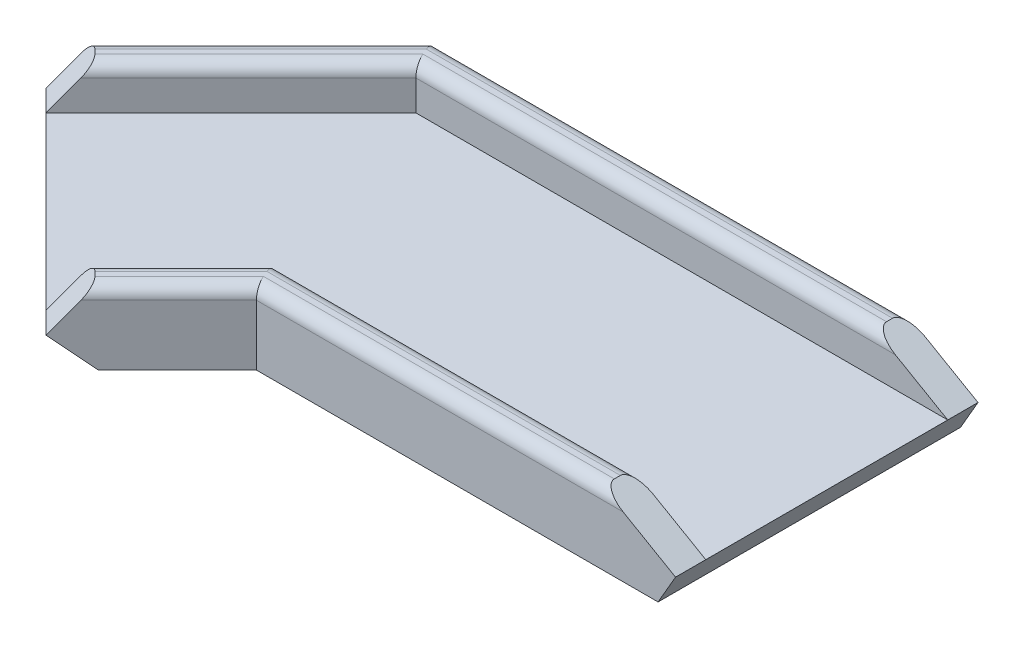
ISO-10303-21;
HEADER;
FILE_DESCRIPTION(('STEP AP214'),'2;1');
FILE_NAME('part.step','',(''),(''),'','','');
FILE_SCHEMA(('AUTOMOTIVE_DESIGN { 1 0 10303 214 1 1 1 1 }'));
ENDSEC;
DATA;
#1=APPLICATION_CONTEXT('core data for automotive mechanical design processes');
#2=APPLICATION_PROTOCOL_DEFINITION('international standard','automotive_design',2000,#1);
#3=PRODUCT_CONTEXT('',#1,'mechanical');
#4=PRODUCT('Part','Part','',(#3));
#5=PRODUCT_RELATED_PRODUCT_CATEGORY('part','',(#4));
#6=PRODUCT_DEFINITION_FORMATION('','',#4);
#7=PRODUCT_DEFINITION_CONTEXT('part definition',#1,'design');
#8=PRODUCT_DEFINITION('design','',#6,#7);
#9=PRODUCT_DEFINITION_SHAPE('','',#8);
#10=(LENGTH_UNIT() NAMED_UNIT(*) SI_UNIT(.MILLI.,.METRE.));
#11=(NAMED_UNIT(*) PLANE_ANGLE_UNIT() SI_UNIT($,.RADIAN.));
#12=(NAMED_UNIT(*) SI_UNIT($,.STERADIAN.) SOLID_ANGLE_UNIT());
#13=UNCERTAINTY_MEASURE_WITH_UNIT(LENGTH_MEASURE(1.E-05),#10,'distance_accuracy_value','');
#14=(GEOMETRIC_REPRESENTATION_CONTEXT(3) GLOBAL_UNCERTAINTY_ASSIGNED_CONTEXT((#13)) GLOBAL_UNIT_ASSIGNED_CONTEXT((#10,
#11,#12)) REPRESENTATION_CONTEXT('',''));
#15=CARTESIAN_POINT('',(0.,0.,0.));
#16=DIRECTION('',(0.,0.,1.));
#17=DIRECTION('',(1.,0.,0.));
#18=AXIS2_PLACEMENT_3D('',#15,#16,#17);
#19=CARTESIAN_POINT('',(0.,3.175,-63.5));
#20=DIRECTION('',(0.,-1.,0.));
#21=DIRECTION('',(0.,0.,-1.));
#22=AXIS2_PLACEMENT_3D('',#19,#20,#21);
#23=PLANE('',#22);
#24=DIRECTION('',(-0.707106781186548,0.,0.707106781186548));
#25=VECTOR('',#24,1.);
#26=CARTESIAN_POINT('',(-33.477694910378,3.175,-6.35));
#27=LINE('',#26,#25);
#28=CARTESIAN_POINT('',(-33.477694910378,3.175,-6.35));
#29=VERTEX_POINT('',#28);
#30=CARTESIAN_POINT('',(-57.4223975332805,3.17499999999999,17.5947026229025));
#31=VERTEX_POINT('',#30);
#32=EDGE_CURVE('E205',#29,#31,#27,.T.);
#33=ORIENTED_EDGE('',*,*,#32,.F.);
#34=DIRECTION('',(-1.,0.,0.));
#35=VECTOR('',#34,1.);
#36=CARTESIAN_POINT('',(-57.15,3.175,-6.35));
#37=LINE('',#36,#35);
#38=CARTESIAN_POINT('',(57.15,3.175,-6.35));
#39=VERTEX_POINT('',#38);
#40=EDGE_CURVE('E375',#39,#29,#37,.T.);
#41=ORIENTED_EDGE('',*,*,#40,.F.);
#42=DIRECTION('',(0.,0.,1.));
#43=VECTOR('',#42,1.);
#44=CARTESIAN_POINT('',(57.15,3.175,-63.5));
#45=LINE('',#44,#43);
#46=CARTESIAN_POINT('',(57.15,3.175,-57.15));
#47=VERTEX_POINT('',#46);
#48=EDGE_CURVE('E390',#47,#39,#45,.T.);
#49=ORIENTED_EDGE('',*,*,#48,.F.);
#50=DIRECTION('',(1.,0.,0.));
#51=VECTOR('',#50,1.);
#52=CARTESIAN_POINT('',(57.15,3.175,-57.15));
#53=LINE('',#52,#51);
#54=CARTESIAN_POINT('',(-54.5197438789309,3.175,-57.15));
#55=VERTEX_POINT('',#54);
#56=EDGE_CURVE('E284',#55,#47,#53,.T.);
#57=ORIENTED_EDGE('',*,*,#56,.F.);
#58=DIRECTION('',(0.707106781186553,0.,-0.707106781186542));
#59=VECTOR('',#58,1.);
#60=CARTESIAN_POINT('',(-93.3434220175569,3.175,-18.3263218613746));
#61=LINE('',#60,#59);
#62=CARTESIAN_POINT('',(-93.3434220175569,3.17499999999999,-18.3263218613746));
#63=VERTEX_POINT('',#62);
#64=EDGE_CURVE('E200',#63,#55,#61,.T.);
#65=ORIENTED_EDGE('',*,*,#64,.F.);
#66=DIRECTION('',(0.707106781186542,0.,0.707106781186553));
#67=VECTOR('',#66,1.);
#68=CARTESIAN_POINT('',(-97.8335500780916,3.175,-22.8164499219093));
#69=LINE('',#68,#67);
#70=EDGE_CURVE('E202',#63,#31,#69,.T.);
#71=ORIENTED_EDGE('',*,*,#70,.T.);
#72=EDGE_LOOP('',(#33,#41,#49,#57,#65,#71));
#73=FACE_BOUND('',#72,.T.);
#74=ADVANCED_FACE('F36',(#73),#23,.F.);
#75=CARTESIAN_POINT('',(0.,-3.175,-63.5));
#76=DIRECTION('',(0.,-1.,0.));
#77=DIRECTION('',(0.,0.,-1.));
#78=AXIS2_PLACEMENT_3D('',#75,#76,#77);
#79=PLANE('',#78);
#80=DIRECTION('',(0.707106781186541,0.,0.707106781186554));
#81=VECTOR('',#80,1.);
#82=CARTESIAN_POINT('',(-112.676076303106,-3.175,-48.6574987749863));
#83=LINE('',#82,#81);
#84=CARTESIAN_POINT('',(-92.3342887640602,-3.17499999999999,-28.3157112359405));
#85=VERTEX_POINT('',#84);
#86=CARTESIAN_POINT('',(-47.4330081587148,-3.175,16.5855693694056));
#87=VERTEX_POINT('',#86);
#88=EDGE_CURVE('E172',#85,#87,#83,.T.);
#89=ORIENTED_EDGE('',*,*,#88,.F.);
#90=DIRECTION('',(-0.707106781186553,0.,0.707106781186542));
#91=VECTOR('',#90,1.);
#92=CARTESIAN_POINT('',(-57.1500000000001,-3.175,-63.5000000000001));
#93=LINE('',#92,#91);
#94=CARTESIAN_POINT('',(-57.15,-3.175,-63.5));
#95=VERTEX_POINT('',#94);
#96=EDGE_CURVE('E199',#95,#85,#93,.T.);
#97=ORIENTED_EDGE('',*,*,#96,.F.);
#98=DIRECTION('',(1.,0.,0.));
#99=VECTOR('',#98,1.);
#100=CARTESIAN_POINT('',(0.,-3.175,-63.5));
#101=LINE('',#100,#99);
#102=CARTESIAN_POINT('',(53.4838257906459,-3.175,-63.5));
#103=VERTEX_POINT('',#102);
#104=EDGE_CURVE('E279',#95,#103,#101,.T.);
#105=ORIENTED_EDGE('',*,*,#104,.T.);
#106=DIRECTION('',(0.,0.,1.));
#107=VECTOR('',#106,1.);
#108=CARTESIAN_POINT('',(53.4838257906459,-3.175,-63.5));
#109=LINE('',#108,#107);
#110=CARTESIAN_POINT('',(53.4838257906459,-3.175,0.));
#111=VERTEX_POINT('',#110);
#112=EDGE_CURVE('E227',#103,#111,#109,.T.);
#113=ORIENTED_EDGE('',*,*,#112,.T.);
#114=DIRECTION('',(1.,0.,0.));
#115=VECTOR('',#114,1.);
#116=CARTESIAN_POINT('',(0.,-3.175,0.));
#117=LINE('',#116,#115);
#118=CARTESIAN_POINT('',(-30.8474387893089,-3.175,0.));
#119=VERTEX_POINT('',#118);
#120=EDGE_CURVE('E198',#119,#111,#117,.T.);
#121=ORIENTED_EDGE('',*,*,#120,.F.);
#122=DIRECTION('',(0.707106781186554,0.,-0.707106781186542));
#123=VECTOR('',#122,1.);
#124=CARTESIAN_POINT('',(-52.9322694727462,-3.175,22.0848306834369));
#125=LINE('',#124,#123);
#126=EDGE_CURVE('E191',#87,#119,#125,.T.);
#127=ORIENTED_EDGE('',*,*,#126,.F.);
#128=EDGE_LOOP('',(#89,#97,#105,#113,#121,#127));
#129=FACE_BOUND('',#128,.T.);
#130=ADVANCED_FACE('F196',(#129),#79,.T.);
#131=CARTESIAN_POINT('',(0.,0.,-63.5));
#132=DIRECTION('',(0.,0.,1.));
#133=DIRECTION('',(1.,0.,0.));
#134=AXIS2_PLACEMENT_3D('',#131,#132,#133);
#135=PLANE('',#134);
#136=DIRECTION('',(0.,-1.,0.));
#137=VECTOR('',#136,1.);
#138=CARTESIAN_POINT('',(-57.15,0.,-63.5));
#139=LINE('',#138,#137);
#140=CARTESIAN_POINT('',(-57.15,9.525,-63.5));
#141=VERTEX_POINT('',#140);
#142=EDGE_CURVE('E276',#141,#95,#139,.T.);
#143=ORIENTED_EDGE('',*,*,#142,.F.);
#144=DIRECTION('',(-1.,0.,0.));
#145=VECTOR('',#144,1.);
#146=CARTESIAN_POINT('',(0.,9.525,-63.5));
#147=LINE('',#146,#145);
#148=CARTESIAN_POINT('',(46.1514773719375,9.525,-63.5));
#149=VERTEX_POINT('',#148);
#150=EDGE_CURVE('E270',#141,#149,#147,.F.);
#151=ORIENTED_EDGE('',*,*,#150,.T.);
#152=DIRECTION('',(0.866025403784442,-0.499999999999995,0.));
#153=VECTOR('',#152,1.);
#154=CARTESIAN_POINT('',(57.15,3.175,-63.5));
#155=LINE('',#154,#153);
#156=CARTESIAN_POINT('',(57.15,3.175,-63.5));
#157=VERTEX_POINT('',#156);
#158=EDGE_CURVE('E217',#149,#157,#155,.T.);
#159=ORIENTED_EDGE('',*,*,#158,.T.);
#160=DIRECTION('',(-0.499999999999996,-0.866025403784441,0.));
#161=VECTOR('',#160,1.);
#162=CARTESIAN_POINT('',(57.15,3.175,-63.5));
#163=LINE('',#162,#161);
#164=EDGE_CURVE('E219',#157,#103,#163,.T.);
#165=ORIENTED_EDGE('',*,*,#164,.T.);
#166=ORIENTED_EDGE('',*,*,#104,.F.);
#167=EDGE_LOOP('',(#143,#151,#159,#165,#166));
#168=FACE_BOUND('',#167,.T.);
#169=ADVANCED_FACE('F335',(#168),#135,.F.);
#170=CARTESIAN_POINT('',(0.,0.,0.));
#171=DIRECTION('',(0.,0.,1.));
#172=DIRECTION('',(1.,0.,0.));
#173=AXIS2_PLACEMENT_3D('',#170,#171,#172);
#174=PLANE('',#173);
#175=DIRECTION('',(0.866025403784442,-0.499999999999995,0.));
#176=VECTOR('',#175,1.);
#177=CARTESIAN_POINT('',(57.15,3.175,0.));
#178=LINE('',#177,#176);
#179=CARTESIAN_POINT('',(46.1514773719375,9.525,0.));
#180=VERTEX_POINT('',#179);
#181=CARTESIAN_POINT('',(57.15,3.175,0.));
#182=VERTEX_POINT('',#181);
#183=EDGE_CURVE('E216',#180,#182,#178,.T.);
#184=ORIENTED_EDGE('',*,*,#183,.F.);
#185=DIRECTION('',(1.,0.,0.));
#186=VECTOR('',#185,1.);
#187=CARTESIAN_POINT('',(-30.8474387893089,9.525,0.));
#188=LINE('',#187,#186);
#189=CARTESIAN_POINT('',(-30.8474387893089,9.52499999999999,0.));
#190=VERTEX_POINT('',#189);
#191=EDGE_CURVE('E304',#180,#190,#188,.F.);
#192=ORIENTED_EDGE('',*,*,#191,.T.);
#193=DIRECTION('',(0.,1.,0.));
#194=VECTOR('',#193,1.);
#195=CARTESIAN_POINT('',(-30.8474387893089,-3.175,0.));
#196=LINE('',#195,#194);
#197=EDGE_CURVE('E209',#119,#190,#196,.T.);
#198=ORIENTED_EDGE('',*,*,#197,.F.);
#199=ORIENTED_EDGE('',*,*,#120,.T.);
#200=DIRECTION('',(-0.499999999999996,-0.866025403784441,0.));
#201=VECTOR('',#200,1.);
#202=CARTESIAN_POINT('',(57.15,3.175,0.));
#203=LINE('',#202,#201);
#204=EDGE_CURVE('E220',#182,#111,#203,.T.);
#205=ORIENTED_EDGE('',*,*,#204,.F.);
#206=EDGE_LOOP('',(#184,#192,#198,#199,#205));
#207=FACE_BOUND('',#206,.T.);
#208=ADVANCED_FACE('F423',(#207),#174,.T.);
#209=CARTESIAN_POINT('',(57.15,12.065,-57.15));
#210=DIRECTION('',(0.,0.,-1.));
#211=DIRECTION('',(-1.,0.,0.));
#212=AXIS2_PLACEMENT_3D('',#209,#210,#211);
#213=PLANE('',#212);
#214=DIRECTION('',(-0.866025403784442,0.499999999999995,0.));
#215=VECTOR('',#214,1.);
#216=CARTESIAN_POINT('',(53.3005170801782,5.39749999999995,-57.15));
#217=LINE('',#216,#215);
#218=CARTESIAN_POINT('',(46.1514773719375,9.525,-57.15));
#219=VERTEX_POINT('',#218);
#220=EDGE_CURVE('E381',#47,#219,#217,.T.);
#221=ORIENTED_EDGE('',*,*,#220,.T.);
#222=DIRECTION('',(1.,0.,0.));
#223=VECTOR('',#222,1.);
#224=CARTESIAN_POINT('',(57.15,9.525,-57.15));
#225=LINE('',#224,#223);
#226=CARTESIAN_POINT('',(-54.5197438789309,9.525,-57.15));
#227=VERTEX_POINT('',#226);
#228=EDGE_CURVE('E268',#219,#227,#225,.F.);
#229=ORIENTED_EDGE('',*,*,#228,.T.);
#230=DIRECTION('',(0.,-1.,0.));
#231=VECTOR('',#230,1.);
#232=CARTESIAN_POINT('',(-54.5197438789309,12.065,-57.15));
#233=LINE('',#232,#231);
#234=EDGE_CURVE('E214',#227,#55,#233,.T.);
#235=ORIENTED_EDGE('',*,*,#234,.T.);
#236=ORIENTED_EDGE('',*,*,#56,.T.);
#237=EDGE_LOOP('',(#221,#229,#235,#236));
#238=FACE_BOUND('',#237,.T.);
#239=ADVANCED_FACE('F531',(#238),#213,.F.);
#240=CARTESIAN_POINT('',(0.,12.065,0.));
#241=DIRECTION('',(0.,-1.,0.));
#242=DIRECTION('',(0.,0.,-1.));
#243=AXIS2_PLACEMENT_3D('',#240,#241,#242);
#244=PLANE('',#243);
#245=DIRECTION('',(0.707106781186553,0.,-0.707106781186542));
#246=VECTOR('',#245,1.);
#247=CARTESIAN_POINT('',(-58.5289487757858,12.065,-58.5289487757868));
#248=LINE('',#247,#246);
#249=CARTESIAN_POINT('',(-56.0978975515725,12.065,-60.96));
#250=VERTEX_POINT('',#249);
#251=CARTESIAN_POINT('',(-90.904854960782,12.065,-26.1530425907911));
#252=VERTEX_POINT('',#251);
#253=EDGE_CURVE('E313',#250,#252,#248,.F.);
#254=ORIENTED_EDGE('',*,*,#253,.T.);
#255=DIRECTION('',(0.707106781186542,0.,0.707106781186554));
#256=VECTOR('',#255,1.);
#257=CARTESIAN_POINT('',(-32.3759061849963,12.065,32.3759061849957));
#258=LINE('',#257,#256);
#259=CARTESIAN_POINT('',(-90.006829348675,12.065,-25.2550169786841));
#260=VERTEX_POINT('',#259);
#261=EDGE_CURVE('E50',#252,#260,#258,.T.);
#262=ORIENTED_EDGE('',*,*,#261,.T.);
#263=DIRECTION('',(-0.707106781186553,0.,0.707106781186542));
#264=VECTOR('',#263,1.);
#265=CARTESIAN_POINT('',(-57.6309231636788,12.065,-57.6309231636797));
#266=LINE('',#265,#264);
#267=CARTESIAN_POINT('',(-55.5718463273586,12.065,-59.69));
#268=VERTEX_POINT('',#267);
#269=EDGE_CURVE('E272',#260,#268,#266,.F.);
#270=ORIENTED_EDGE('',*,*,#269,.T.);
#271=DIRECTION('',(1.,0.,0.));
#272=VECTOR('',#271,1.);
#273=CARTESIAN_POINT('',(0.,12.065,-59.69));
#274=LINE('',#273,#272);
#275=CARTESIAN_POINT('',(41.7520683207125,12.065,-59.69));
#276=VERTEX_POINT('',#275);
#277=EDGE_CURVE('E266',#268,#276,#274,.T.);
#278=ORIENTED_EDGE('',*,*,#277,.T.);
#279=DIRECTION('',(0.,0.,1.));
#280=VECTOR('',#279,1.);
#281=CARTESIAN_POINT('',(41.7520683207125,12.065,-63.5));
#282=LINE('',#281,#280);
#283=CARTESIAN_POINT('',(41.7520683207125,12.065,-60.96));
#284=VERTEX_POINT('',#283);
#285=EDGE_CURVE('E223',#284,#276,#282,.T.);
#286=ORIENTED_EDGE('',*,*,#285,.F.);
#287=DIRECTION('',(-1.,0.,0.));
#288=VECTOR('',#287,1.);
#289=CARTESIAN_POINT('',(0.,12.065,-60.96));
#290=LINE('',#289,#288);
#291=EDGE_CURVE('E316',#284,#250,#290,.T.);
#292=ORIENTED_EDGE('',*,*,#291,.T.);
#293=EDGE_LOOP('',(#254,#262,#270,#278,#286,#292));
#294=FACE_BOUND('',#293,.T.);
#295=ADVANCED_FACE('F319',(#294),#244,.F.);
#296=CARTESIAN_POINT('',(-57.15,12.065,-6.35));
#297=DIRECTION('',(0.,0.,1.));
#298=DIRECTION('',(1.,0.,0.));
#299=AXIS2_PLACEMENT_3D('',#296,#297,#298);
#300=PLANE('',#299);
#301=DIRECTION('',(0.,1.,0.));
#302=VECTOR('',#301,1.);
#303=CARTESIAN_POINT('',(-33.477694910378,12.065,-6.35));
#304=LINE('',#303,#302);
#305=CARTESIAN_POINT('',(-33.477694910378,9.52499999999999,-6.35));
#306=VERTEX_POINT('',#305);
#307=EDGE_CURVE('E211',#29,#306,#304,.T.);
#308=ORIENTED_EDGE('',*,*,#307,.T.);
#309=DIRECTION('',(-1.,0.,0.));
#310=VECTOR('',#309,1.);
#311=CARTESIAN_POINT('',(-57.15,9.525,-6.35));
#312=LINE('',#311,#310);
#313=CARTESIAN_POINT('',(46.1514773719375,9.52499999999999,-6.35));
#314=VERTEX_POINT('',#313);
#315=EDGE_CURVE('E306',#306,#314,#312,.F.);
#316=ORIENTED_EDGE('',*,*,#315,.T.);
#317=DIRECTION('',(0.866025403784442,-0.499999999999995,0.));
#318=VECTOR('',#317,1.);
#319=CARTESIAN_POINT('',(-32.4244829198224,54.8908518262803,-6.35));
#320=LINE('',#319,#318);
#321=EDGE_CURVE('E229',#314,#39,#320,.T.);
#322=ORIENTED_EDGE('',*,*,#321,.T.);
#323=ORIENTED_EDGE('',*,*,#40,.T.);
#324=EDGE_LOOP('',(#308,#316,#322,#323));
#325=FACE_BOUND('',#324,.T.);
#326=ADVANCED_FACE('F378',(#325),#300,.F.);
#327=CARTESIAN_POINT('',(0.,12.065,0.));
#328=DIRECTION('',(0.,-1.,0.));
#329=DIRECTION('',(0.,0.,-1.));
#330=AXIS2_PLACEMENT_3D('',#327,#328,#329);
#331=PLANE('',#330);
#332=DIRECTION('',(0.707106781186547,0.,-0.707106781186548));
#333=VECTOR('',#332,1.);
#334=CARTESIAN_POINT('',(-18.1177962309752,12.065,-18.1177962309752));
#335=LINE('',#334,#333);
#336=CARTESIAN_POINT('',(-32.4255924619504,12.065,-3.81));
#337=VERTEX_POINT('',#336);
#338=CARTESIAN_POINT('',(-50.493702415971,12.065,14.2581099540206));
#339=VERTEX_POINT('',#338);
#340=EDGE_CURVE('E289',#337,#339,#335,.F.);
#341=ORIENTED_EDGE('',*,*,#340,.T.);
#342=DIRECTION('',(0.707106781186542,0.,0.707106781186554));
#343=VECTOR('',#342,1.);
#344=CARTESIAN_POINT('',(-32.3759061849963,12.065,32.3759061849957));
#345=LINE('',#344,#343);
#346=CARTESIAN_POINT('',(-49.5956768038643,12.065,15.1561355661274));
#347=VERTEX_POINT('',#346);
#348=EDGE_CURVE('E360',#339,#347,#345,.T.);
#349=ORIENTED_EDGE('',*,*,#348,.T.);
#350=DIRECTION('',(-0.707106781186554,0.,0.707106781186542));
#351=VECTOR('',#350,1.);
#352=CARTESIAN_POINT('',(-17.219770618868,12.065,-17.2197706188683));
#353=LINE('',#352,#351);
#354=CARTESIAN_POINT('',(-31.8995412377366,12.065,-2.54));
#355=VERTEX_POINT('',#354);
#356=EDGE_CURVE('E298',#347,#355,#353,.F.);
#357=ORIENTED_EDGE('',*,*,#356,.T.);
#358=DIRECTION('',(1.,0.,0.));
#359=VECTOR('',#358,1.);
#360=CARTESIAN_POINT('',(41.7520683207125,12.065,-2.54));
#361=LINE('',#360,#359);
#362=CARTESIAN_POINT('',(41.7520683207125,12.065,-2.54));
#363=VERTEX_POINT('',#362);
#364=EDGE_CURVE('E296',#355,#363,#361,.T.);
#365=ORIENTED_EDGE('',*,*,#364,.T.);
#366=DIRECTION('',(0.,0.,-1.));
#367=VECTOR('',#366,1.);
#368=CARTESIAN_POINT('',(41.7520683207125,12.065,0.));
#369=LINE('',#368,#367);
#370=CARTESIAN_POINT('',(41.7520683207125,12.065,-3.81));
#371=VERTEX_POINT('',#370);
#372=EDGE_CURVE('E290',#363,#371,#369,.T.);
#373=ORIENTED_EDGE('',*,*,#372,.T.);
#374=DIRECTION('',(-1.,0.,0.));
#375=VECTOR('',#374,1.);
#376=CARTESIAN_POINT('',(0.,12.065,-3.81));
#377=LINE('',#376,#375);
#378=EDGE_CURVE('E293',#371,#337,#377,.T.);
#379=ORIENTED_EDGE('',*,*,#378,.T.);
#380=EDGE_LOOP('',(#341,#349,#357,#365,#373,#379));
#381=FACE_BOUND('',#380,.T.);
#382=ADVANCED_FACE('F398',(#381),#331,.F.);
#383=CARTESIAN_POINT('',(57.15,3.175,-63.5));
#384=DIRECTION('',(-0.499999999999995,-0.866025403784442,0.));
#385=DIRECTION('',(0.866025403784442,-0.499999999999995,0.));
#386=AXIS2_PLACEMENT_3D('',#383,#384,#385);
#387=PLANE('',#386);
#388=ORIENTED_EDGE('',*,*,#285,.T.);
#389=CARTESIAN_POINT('',(46.1514773719375,9.525,-59.69));
#390=DIRECTION('',(-0.499999999999995,-0.866025403784442,0.));
#391=DIRECTION('',(0.866025403784442,-0.499999999999995,0.));
#392=AXIS2_PLACEMENT_3D('',#389,#390,#391);
#393=ELLIPSE('',#392,5.08000000000005,2.54);
#394=EDGE_CURVE('E253',#276,#219,#393,.F.);
#395=ORIENTED_EDGE('',*,*,#394,.T.);
#396=ORIENTED_EDGE('',*,*,#220,.F.);
#397=DIRECTION('',(0.,0.,1.));
#398=VECTOR('',#397,1.);
#399=CARTESIAN_POINT('',(57.15,3.175,-63.5));
#400=LINE('',#399,#398);
#401=EDGE_CURVE('E230',#157,#47,#400,.T.);
#402=ORIENTED_EDGE('',*,*,#401,.F.);
#403=ORIENTED_EDGE('',*,*,#158,.F.);
#404=CARTESIAN_POINT('',(46.1514773719375,9.525,-60.96));
#405=DIRECTION('',(-0.499999999999995,-0.866025403784442,0.));
#406=DIRECTION('',(-0.866025403784442,0.499999999999995,0.));
#407=AXIS2_PLACEMENT_3D('',#404,#405,#406);
#408=ELLIPSE('',#407,5.08000000000005,2.54);
#409=EDGE_CURVE('E257',#149,#284,#408,.F.);
#410=ORIENTED_EDGE('',*,*,#409,.T.);
#411=EDGE_LOOP('',(#388,#395,#396,#402,#403,#410));
#412=FACE_BOUND('',#411,.T.);
#413=ADVANCED_FACE('F251',(#412),#387,.F.);
#414=ORIENTED_EDGE('',*,*,#372,.F.);
#415=CARTESIAN_POINT('',(46.1514773719375,9.525,-2.54));
#416=DIRECTION('',(-0.499999999999995,-0.866025403784442,0.));
#417=DIRECTION('',(-0.866025403784442,0.499999999999995,0.));
#418=AXIS2_PLACEMENT_3D('',#415,#416,#417);
#419=ELLIPSE('',#418,5.08000000000005,2.54);
#420=EDGE_CURVE('E302',#363,#180,#419,.F.);
#421=ORIENTED_EDGE('',*,*,#420,.T.);
#422=ORIENTED_EDGE('',*,*,#183,.T.);
#423=EDGE_CURVE('E236',#39,#182,#400,.T.);
#424=ORIENTED_EDGE('',*,*,#423,.F.);
#425=ORIENTED_EDGE('',*,*,#321,.F.);
#426=CARTESIAN_POINT('',(46.1514773719375,9.525,-3.81));
#427=DIRECTION('',(-0.499999999999995,-0.866025403784442,0.));
#428=DIRECTION('',(-0.866025403784442,0.499999999999995,0.));
#429=AXIS2_PLACEMENT_3D('',#426,#427,#428);
#430=ELLIPSE('',#429,5.08000000000005,2.54);
#431=EDGE_CURVE('E300',#314,#371,#430,.F.);
#432=ORIENTED_EDGE('',*,*,#431,.T.);
#433=EDGE_LOOP('',(#414,#421,#422,#424,#425,#432));
#434=FACE_BOUND('',#433,.T.);
#435=ADVANCED_FACE('F421',(#434),#387,.F.);
#436=CARTESIAN_POINT('',(57.15,3.175,-63.5));
#437=DIRECTION('',(-0.866025403784441,0.499999999999996,0.));
#438=DIRECTION('',(-0.499999999999996,-0.866025403784441,0.));
#439=AXIS2_PLACEMENT_3D('',#436,#437,#438);
#440=PLANE('',#439);
#441=ORIENTED_EDGE('',*,*,#204,.T.);
#442=ORIENTED_EDGE('',*,*,#112,.F.);
#443=ORIENTED_EDGE('',*,*,#164,.F.);
#444=ORIENTED_EDGE('',*,*,#401,.T.);
#445=ORIENTED_EDGE('',*,*,#48,.T.);
#446=ORIENTED_EDGE('',*,*,#423,.T.);
#447=EDGE_LOOP('',(#441,#442,#443,#444,#445,#446));
#448=FACE_BOUND('',#447,.T.);
#449=ADVANCED_FACE('F424',(#448),#440,.F.);
#450=CARTESIAN_POINT('',(-52.9322694727462,3.175,22.0848306834369));
#451=DIRECTION('',(-0.707106781186542,0.,-0.707106781186554));
#452=DIRECTION('',(-0.707106781186554,0.,0.707106781186542));
#453=AXIS2_PLACEMENT_3D('',#450,#451,#452);
#454=PLANE('',#453);
#455=DIRECTION('',(-0.707106781186554,0.,0.707106781186542));
#456=VECTOR('',#455,1.);
#457=CARTESIAN_POINT('',(-52.9322694727462,9.525,22.0848306834369));
#458=LINE('',#457,#456);
#459=CARTESIAN_POINT('',(-49.2660952633921,9.525,18.4186564740829));
#460=VERTEX_POINT('',#459);
#461=EDGE_CURVE('E287',#190,#460,#458,.T.);
#462=ORIENTED_EDGE('',*,*,#461,.T.);
#463=DIRECTION('',(0.447213595499956,0.77459666924149,-0.447213595499948));
#464=VECTOR('',#463,1.);
#465=CARTESIAN_POINT('',(-47.2526568098967,13.0123776993669,16.4052180205875));
#466=LINE('',#465,#464);
#467=CARTESIAN_POINT('',(-52.9322694727462,3.175,22.0848306834369));
#468=VERTEX_POINT('',#467);
#469=EDGE_CURVE('E193',#468,#460,#466,.T.);
#470=ORIENTED_EDGE('',*,*,#469,.F.);
#471=DIRECTION('',(-0.547722557505176,0.632455532033667,0.547722557505166));
#472=VECTOR('',#471,1.);
#473=CARTESIAN_POINT('',(-52.9322694727462,3.175,22.0848306834369));
#474=LINE('',#473,#472);
#475=EDGE_CURVE('E176',#87,#468,#474,.T.);
#476=ORIENTED_EDGE('',*,*,#475,.F.);
#477=ORIENTED_EDGE('',*,*,#126,.T.);
#478=ORIENTED_EDGE('',*,*,#197,.T.);
#479=EDGE_LOOP('',(#462,#470,#476,#477,#478));
#480=FACE_BOUND('',#479,.T.);
#481=ADVANCED_FACE('F189',(#480),#454,.F.);
#482=CARTESIAN_POINT('',(-57.1500000000001,3.175,-63.5000000000001));
#483=DIRECTION('',(0.707106781186542,0.,0.707106781186553));
#484=DIRECTION('',(0.707106781186553,0.,-0.707106781186542));
#485=AXIS2_PLACEMENT_3D('',#482,#483,#484);
#486=PLANE('',#485);
#487=DIRECTION('',(-0.547722557505176,0.632455532033667,0.547722557505167));
#488=VECTOR('',#487,1.);
#489=CARTESIAN_POINT('',(-73.4234200312362,-25.0113903070105,-47.2265799687642));
#490=LINE('',#489,#488);
#491=CARTESIAN_POINT('',(-97.8335500780915,3.175,-22.8164499219093));
#492=VERTEX_POINT('',#491);
#493=EDGE_CURVE('E180',#85,#492,#490,.T.);
#494=ORIENTED_EDGE('',*,*,#493,.T.);
#495=DIRECTION('',(0.447213595499956,0.77459666924149,-0.447213595499948));
#496=VECTOR('',#495,1.);
#497=CARTESIAN_POINT('',(-81.5601300468554,31.3613903070105,-39.0898699531452));
#498=LINE('',#497,#496);
#499=CARTESIAN_POINT('',(-94.1673758687375,9.525,-26.4826241312633));
#500=VERTEX_POINT('',#499);
#501=EDGE_CURVE('E344',#492,#500,#498,.T.);
#502=ORIENTED_EDGE('',*,*,#501,.T.);
#503=DIRECTION('',(0.707106781186553,0.,-0.707106781186542));
#504=VECTOR('',#503,1.);
#505=CARTESIAN_POINT('',(-57.1500000000001,9.525,-63.5000000000001));
#506=LINE('',#505,#504);
#507=EDGE_CURVE('E44',#500,#141,#506,.T.);
#508=ORIENTED_EDGE('',*,*,#507,.T.);
#509=ORIENTED_EDGE('',*,*,#142,.T.);
#510=ORIENTED_EDGE('',*,*,#96,.T.);
#511=EDGE_LOOP('',(#494,#502,#508,#509,#510));
#512=FACE_BOUND('',#511,.T.);
#513=ADVANCED_FACE('F345',(#512),#486,.F.);
#514=CARTESIAN_POINT('',(-93.3434220175569,74.6489196921268,-18.3263218613746));
#515=DIRECTION('',(-0.707106781186542,0.,-0.707106781186553));
#516=DIRECTION('',(-0.707106781186553,0.,0.707106781186542));
#517=AXIS2_PLACEMENT_3D('',#514,#515,#516);
#518=PLANE('',#517);
#519=DIRECTION('',(-0.707106781186553,0.,0.707106781186542));
#520=VECTOR('',#519,1.);
#521=CARTESIAN_POINT('',(-93.3434220175569,9.52499999999999,-18.3263218613746));
#522=LINE('',#521,#520);
#523=CARTESIAN_POINT('',(-89.6772478082028,9.52499999999999,-21.9924960707286));
#524=VERTEX_POINT('',#523);
#525=EDGE_CURVE('E310',#227,#524,#522,.T.);
#526=ORIENTED_EDGE('',*,*,#525,.T.);
#527=DIRECTION('',(-0.447213595499956,-0.77459666924149,0.447213595499949));
#528=VECTOR('',#527,1.);
#529=CARTESIAN_POINT('',(-68.5841299529845,46.0593518152768,-43.0856139259466));
#530=LINE('',#529,#528);
#531=EDGE_CURVE('E352',#524,#63,#530,.T.);
#532=ORIENTED_EDGE('',*,*,#531,.T.);
#533=ORIENTED_EDGE('',*,*,#64,.T.);
#534=ORIENTED_EDGE('',*,*,#234,.F.);
#535=EDGE_LOOP('',(#526,#532,#533,#534));
#536=FACE_BOUND('',#535,.T.);
#537=ADVANCED_FACE('F492',(#536),#518,.F.);
#538=CARTESIAN_POINT('',(-33.477694910378,74.6489196921268,-6.35));
#539=DIRECTION('',(0.707106781186548,0.,0.707106781186547));
#540=DIRECTION('',(0.707106781186547,0.,-0.707106781186548));
#541=AXIS2_PLACEMENT_3D('',#538,#539,#540);
#542=PLANE('',#541);
#543=ORIENTED_EDGE('',*,*,#32,.T.);
#544=DIRECTION('',(0.447213595499952,0.77459666924149,-0.447213595499952));
#545=VECTOR('',#544,1.);
#546=CARTESIAN_POINT('',(-23.0852244195476,62.6487284212747,-16.7424704908304));
#547=LINE('',#546,#545);
#548=CARTESIAN_POINT('',(-53.7562233239264,9.52499999999999,13.9285284135484));
#549=VERTEX_POINT('',#548);
#550=EDGE_CURVE('E357',#31,#549,#547,.T.);
#551=ORIENTED_EDGE('',*,*,#550,.T.);
#552=DIRECTION('',(0.707106781186547,0.,-0.707106781186548));
#553=VECTOR('',#552,1.);
#554=CARTESIAN_POINT('',(-33.477694910378,9.52499999999999,-6.35));
#555=LINE('',#554,#553);
#556=EDGE_CURVE('E308',#549,#306,#555,.T.);
#557=ORIENTED_EDGE('',*,*,#556,.T.);
#558=ORIENTED_EDGE('',*,*,#307,.F.);
#559=EDGE_LOOP('',(#543,#551,#557,#558));
#560=FACE_BOUND('',#559,.T.);
#561=ADVANCED_FACE('F369',(#560),#542,.F.);
#562=CARTESIAN_POINT('',(0.,9.525,-2.54));
#563=DIRECTION('',(-1.,0.,0.));
#564=DIRECTION('',(0.,0.,1.));
#565=AXIS2_PLACEMENT_3D('',#562,#563,#564);
#566=CYLINDRICAL_SURFACE('',#565,2.54);
#567=ORIENTED_EDGE('',*,*,#420,.F.);
#568=ORIENTED_EDGE('',*,*,#364,.F.);
#569=CARTESIAN_POINT('',(-31.8995412377366,9.525,-2.54));
#570=DIRECTION('',(-0.923879532511288,0.,0.382683432365086));
#571=DIRECTION('',(0.382683432365086,0.,0.923879532511288));
#572=AXIS2_PLACEMENT_3D('',#569,#570,#571);
#573=ELLIPSE('',#572,2.74927618874268,2.54);
#574=EDGE_CURVE('E329',#190,#355,#573,.T.);
#575=ORIENTED_EDGE('',*,*,#574,.F.);
#576=ORIENTED_EDGE('',*,*,#191,.F.);
#577=EDGE_LOOP('',(#567,#568,#575,#576));
#578=FACE_BOUND('',#577,.T.);
#579=ADVANCED_FACE('F419',(#578),#566,.T.);
#580=CARTESIAN_POINT('',(-54.72832069696,9.525,20.288779459223));
#581=DIRECTION('',(-0.707106781186554,0.,0.707106781186542));
#582=DIRECTION('',(0.707106781186542,0.,0.707106781186554));
#583=AXIS2_PLACEMENT_3D('',#580,#581,#582);
#584=CYLINDRICAL_SURFACE('',#583,2.54);
#585=CARTESIAN_POINT('',(-51.0621464876059,9.525,16.622605249869));
#586=DIRECTION('',(0.547722557505175,-0.632455532033668,-0.547722557505166));
#587=DIRECTION('',(-0.447213595499956,-0.77459666924149,0.447213595499948));
#588=AXIS2_PLACEMENT_3D('',#585,#586,#587);
#589=ELLIPSE('',#588,3.27912589978892,2.54);
#590=EDGE_CURVE('E363',#460,#347,#589,.F.);
#591=ORIENTED_EDGE('',*,*,#590,.F.);
#592=ORIENTED_EDGE('',*,*,#461,.F.);
#593=ORIENTED_EDGE('',*,*,#574,.T.);
#594=ORIENTED_EDGE('',*,*,#356,.F.);
#595=EDGE_LOOP('',(#591,#592,#593,#594));
#596=FACE_BOUND('',#595,.T.);
#597=ADVANCED_FACE('F414',(#596),#584,.T.);
#598=CARTESIAN_POINT('',(-31.6816436861642,9.52499999999999,-4.55394877578617));
#599=DIRECTION('',(0.707106781186547,0.,-0.707106781186548));
#600=DIRECTION('',(-0.707106781186548,0.,-0.707106781186547));
#601=AXIS2_PLACEMENT_3D('',#598,#599,#600);
#602=CYLINDRICAL_SURFACE('',#601,2.54);
#603=CARTESIAN_POINT('',(-51.9601720997126,9.52499999999999,15.7245796377623));
#604=DIRECTION('',(0.547722557505175,-0.632455532033668,-0.547722557505166));
#605=DIRECTION('',(0.447213595499946,0.77459666924149,-0.447213595499958));
#606=AXIS2_PLACEMENT_3D('',#603,#604,#605);
#607=ELLIPSE('',#606,3.27912589978892,2.54);
#608=EDGE_CURVE('E355',#339,#549,#607,.F.);
#609=ORIENTED_EDGE('',*,*,#608,.F.);
#610=ORIENTED_EDGE('',*,*,#340,.F.);
#611=CARTESIAN_POINT('',(-32.4255924619504,9.525,-3.81));
#612=DIRECTION('',(0.923879532511287,0.,-0.38268343236509));
#613=DIRECTION('',(-0.38268343236509,0.,-0.923879532511287));
#614=AXIS2_PLACEMENT_3D('',#611,#612,#613);
#615=ELLIPSE('',#614,2.74927618874268,2.54);
#616=EDGE_CURVE('E326',#306,#337,#615,.T.);
#617=ORIENTED_EDGE('',*,*,#616,.F.);
#618=ORIENTED_EDGE('',*,*,#556,.F.);
#619=EDGE_LOOP('',(#609,#610,#617,#618));
#620=FACE_BOUND('',#619,.T.);
#621=ADVANCED_FACE('F409',(#620),#602,.T.);
#622=CARTESIAN_POINT('',(0.,9.525,-3.81));
#623=DIRECTION('',(-1.,0.,0.));
#624=DIRECTION('',(0.,0.,1.));
#625=AXIS2_PLACEMENT_3D('',#622,#623,#624);
#626=CYLINDRICAL_SURFACE('',#625,2.54);
#627=ORIENTED_EDGE('',*,*,#431,.F.);
#628=ORIENTED_EDGE('',*,*,#315,.F.);
#629=ORIENTED_EDGE('',*,*,#616,.T.);
#630=ORIENTED_EDGE('',*,*,#378,.F.);
#631=EDGE_LOOP('',(#627,#628,#629,#630));
#632=FACE_BOUND('',#631,.T.);
#633=ADVANCED_FACE('F404',(#632),#626,.T.);
#634=CARTESIAN_POINT('',(0.,9.525,-59.69));
#635=DIRECTION('',(1.,0.,0.));
#636=DIRECTION('',(0.,0.,-1.));
#637=AXIS2_PLACEMENT_3D('',#634,#635,#636);
#638=CYLINDRICAL_SURFACE('',#637,2.54);
#639=ORIENTED_EDGE('',*,*,#394,.F.);
#640=ORIENTED_EDGE('',*,*,#277,.F.);
#641=CARTESIAN_POINT('',(-55.5718463273586,9.525,-59.69));
#642=DIRECTION('',(-0.923879532511288,0.,0.382683432365086));
#643=DIRECTION('',(0.382683432365086,0.,0.923879532511288));
#644=AXIS2_PLACEMENT_3D('',#641,#642,#643);
#645=ELLIPSE('',#644,2.74927618874268,2.54);
#646=EDGE_CURVE('E325',#227,#268,#645,.T.);
#647=ORIENTED_EDGE('',*,*,#646,.F.);
#648=ORIENTED_EDGE('',*,*,#228,.F.);
#649=EDGE_LOOP('',(#639,#640,#647,#648));
#650=FACE_BOUND('',#649,.T.);
#651=ADVANCED_FACE('F264',(#650),#638,.T.);
#652=CARTESIAN_POINT('',(-95.1394732417707,9.52499999999999,-20.1223730855885));
#653=DIRECTION('',(-0.707106781186553,0.,0.707106781186542));
#654=DIRECTION('',(0.707106781186542,0.,0.707106781186553));
#655=AXIS2_PLACEMENT_3D('',#652,#653,#654);
#656=CYLINDRICAL_SURFACE('',#655,2.54);
#657=CARTESIAN_POINT('',(-91.4732990324167,9.52499999999999,-23.7885472949424));
#658=DIRECTION('',(0.547722557505175,-0.632455532033668,-0.547722557505166));
#659=DIRECTION('',(-0.447213595499955,-0.77459666924149,0.447213595499949));
#660=AXIS2_PLACEMENT_3D('',#657,#658,#659);
#661=ELLIPSE('',#660,3.27912589978892,2.54);
#662=EDGE_CURVE('E324',#524,#260,#661,.F.);
#663=ORIENTED_EDGE('',*,*,#662,.F.);
#664=ORIENTED_EDGE('',*,*,#525,.F.);
#665=ORIENTED_EDGE('',*,*,#646,.T.);
#666=ORIENTED_EDGE('',*,*,#269,.F.);
#667=EDGE_LOOP('',(#663,#664,#665,#666));
#668=FACE_BOUND('',#667,.T.);
#669=ADVANCED_FACE('F322',(#668),#656,.T.);
#670=CARTESIAN_POINT('',(-55.3539487757863,9.525,-61.7039487757863));
#671=DIRECTION('',(0.707106781186553,0.,-0.707106781186542));
#672=DIRECTION('',(-0.707106781186542,0.,-0.707106781186553));
#673=AXIS2_PLACEMENT_3D('',#670,#671,#672);
#674=CYLINDRICAL_SURFACE('',#673,2.54);
#675=CARTESIAN_POINT('',(-92.3713246445237,9.525,-24.6865729070495));
#676=DIRECTION('',(0.547722557505175,-0.632455532033668,-0.547722557505166));
#677=DIRECTION('',(0.447213595499956,0.77459666924149,-0.447213595499949));
#678=AXIS2_PLACEMENT_3D('',#675,#676,#677);
#679=ELLIPSE('',#678,3.27912589978892,2.54);
#680=EDGE_CURVE('E11',#252,#500,#679,.F.);
#681=ORIENTED_EDGE('',*,*,#680,.F.);
#682=ORIENTED_EDGE('',*,*,#253,.F.);
#683=CARTESIAN_POINT('',(-56.0978975515725,9.525,-60.96));
#684=DIRECTION('',(0.923879532511288,0.,-0.382683432365086));
#685=DIRECTION('',(-0.382683432365086,0.,-0.923879532511288));
#686=AXIS2_PLACEMENT_3D('',#683,#684,#685);
#687=ELLIPSE('',#686,2.74927618874268,2.54);
#688=EDGE_CURVE('E327',#141,#250,#687,.T.);
#689=ORIENTED_EDGE('',*,*,#688,.F.);
#690=ORIENTED_EDGE('',*,*,#507,.F.);
#691=EDGE_LOOP('',(#681,#682,#689,#690));
#692=FACE_BOUND('',#691,.T.);
#693=ADVANCED_FACE('F38',(#692),#674,.T.);
#694=CARTESIAN_POINT('',(0.,9.525,-60.96));
#695=DIRECTION('',(-1.,0.,0.));
#696=DIRECTION('',(0.,0.,1.));
#697=AXIS2_PLACEMENT_3D('',#694,#695,#696);
#698=CYLINDRICAL_SURFACE('',#697,2.54);
#699=ORIENTED_EDGE('',*,*,#409,.F.);
#700=ORIENTED_EDGE('',*,*,#150,.F.);
#701=ORIENTED_EDGE('',*,*,#688,.T.);
#702=ORIENTED_EDGE('',*,*,#291,.F.);
#703=EDGE_LOOP('',(#699,#700,#701,#702));
#704=FACE_BOUND('',#703,.T.);
#705=ADVANCED_FACE('F339',(#704),#698,.T.);
#706=CARTESIAN_POINT('',(-118.175337617137,3.175,-43.158237460955));
#707=DIRECTION('',(0.447213595499956,0.77459666924149,-0.447213595499948));
#708=DIRECTION('',(-0.866025403784442,0.499999999999995,0.));
#709=AXIS2_PLACEMENT_3D('',#706,#707,#708);
#710=PLANE('',#709);
#711=ORIENTED_EDGE('',*,*,#88,.T.);
#712=ORIENTED_EDGE('',*,*,#475,.T.);
#713=DIRECTION('',(0.707106781186541,0.,0.707106781186554));
#714=VECTOR('',#713,1.);
#715=CARTESIAN_POINT('',(-118.175337617137,3.175,-43.158237460955));
#716=LINE('',#715,#714);
#717=EDGE_CURVE('E185',#31,#468,#716,.T.);
#718=ORIENTED_EDGE('',*,*,#717,.F.);
#719=ORIENTED_EDGE('',*,*,#70,.F.);
#720=EDGE_CURVE('E346',#492,#63,#716,.T.);
#721=ORIENTED_EDGE('',*,*,#720,.F.);
#722=ORIENTED_EDGE('',*,*,#493,.F.);
#723=EDGE_LOOP('',(#711,#712,#718,#719,#721,#722));
#724=FACE_BOUND('',#723,.T.);
#725=ADVANCED_FACE('F174',(#724),#710,.F.);
#726=CARTESIAN_POINT('',(-112.495724954287,13.0123776993669,-48.8378501238044));
#727=DIRECTION('',(0.547722557505175,-0.632455532033668,-0.547722557505166));
#728=DIRECTION('',(0.755928946018445,0.654653670707988,0.));
#729=AXIS2_PLACEMENT_3D('',#726,#727,#728);
#730=PLANE('',#729);
#731=ORIENTED_EDGE('',*,*,#662,.T.);
#732=ORIENTED_EDGE('',*,*,#261,.F.);
#733=ORIENTED_EDGE('',*,*,#680,.T.);
#734=ORIENTED_EDGE('',*,*,#501,.F.);
#735=ORIENTED_EDGE('',*,*,#720,.T.);
#736=ORIENTED_EDGE('',*,*,#531,.F.);
#737=EDGE_LOOP('',(#731,#732,#733,#734,#735,#736));
#738=FACE_BOUND('',#737,.T.);
#739=ADVANCED_FACE('F342',(#738),#730,.F.);
#740=ORIENTED_EDGE('',*,*,#590,.T.);
#741=ORIENTED_EDGE('',*,*,#348,.F.);
#742=ORIENTED_EDGE('',*,*,#608,.T.);
#743=ORIENTED_EDGE('',*,*,#550,.F.);
#744=ORIENTED_EDGE('',*,*,#717,.T.);
#745=ORIENTED_EDGE('',*,*,#469,.T.);
#746=EDGE_LOOP('',(#740,#741,#742,#743,#744,#745));
#747=FACE_BOUND('',#746,.T.);
#748=ADVANCED_FACE('F567',(#747),#730,.F.);
#749=CLOSED_SHELL('',(#74,#130,#169,#208,#239,#295,#326,#382,#413,#435,#449,#481,#513,#537,#561,
#579,#597,#621,#633,#651,#669,#693,#705,#725,#739,#748));
#750=MANIFOLD_SOLID_BREP('B2',#749);
#751=ADVANCED_BREP_SHAPE_REPRESENTATION('',(#18,#750),#14);
#752=SHAPE_DEFINITION_REPRESENTATION(#9,#751);
ENDSEC;
END-ISO-10303-21;
